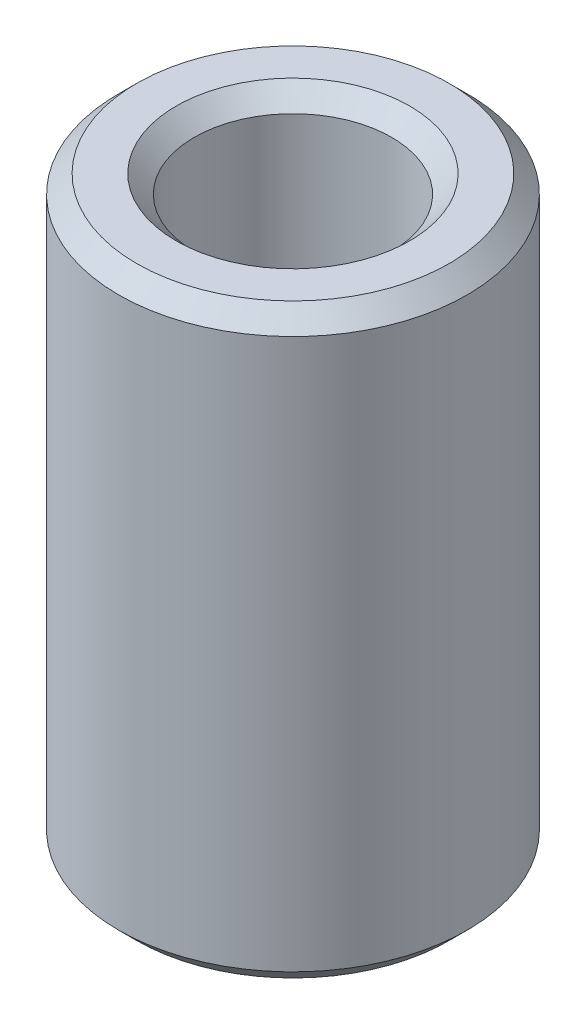
ISO-10303-21;
HEADER;
FILE_DESCRIPTION(('STEP AP214'),'2;1');
FILE_NAME('part.step','',(''),(''),'','','');
FILE_SCHEMA(('AUTOMOTIVE_DESIGN { 1 0 10303 214 1 1 1 1 }'));
ENDSEC;
DATA;
#1=APPLICATION_CONTEXT('core data for automotive mechanical design processes');
#2=APPLICATION_PROTOCOL_DEFINITION('international standard','automotive_design',2000,#1);
#3=PRODUCT_CONTEXT('',#1,'mechanical');
#4=PRODUCT('Part','Part','',(#3));
#5=PRODUCT_RELATED_PRODUCT_CATEGORY('part','',(#4));
#6=PRODUCT_DEFINITION_FORMATION('','',#4);
#7=PRODUCT_DEFINITION_CONTEXT('part definition',#1,'design');
#8=PRODUCT_DEFINITION('design','',#6,#7);
#9=PRODUCT_DEFINITION_SHAPE('','',#8);
#10=(LENGTH_UNIT() NAMED_UNIT(*) SI_UNIT(.MILLI.,.METRE.));
#11=(NAMED_UNIT(*) PLANE_ANGLE_UNIT() SI_UNIT($,.RADIAN.));
#12=(NAMED_UNIT(*) SI_UNIT($,.STERADIAN.) SOLID_ANGLE_UNIT());
#13=UNCERTAINTY_MEASURE_WITH_UNIT(LENGTH_MEASURE(1.E-05),#10,'distance_accuracy_value','');
#14=(GEOMETRIC_REPRESENTATION_CONTEXT(3) GLOBAL_UNCERTAINTY_ASSIGNED_CONTEXT((#13)) GLOBAL_UNIT_ASSIGNED_CONTEXT((#10,
#11,#12)) REPRESENTATION_CONTEXT('',''));
#15=CARTESIAN_POINT('',(0.,0.,0.));
#16=DIRECTION('',(0.,0.,1.));
#17=DIRECTION('',(1.,0.,0.));
#18=AXIS2_PLACEMENT_3D('',#15,#16,#17);
#19=CARTESIAN_POINT('',(0.,16.8244387498127,0.));
#20=DIRECTION('',(0.,-1.,0.));
#21=DIRECTION('',(0.,0.,-1.));
#22=AXIS2_PLACEMENT_3D('',#19,#20,#21);
#23=CYLINDRICAL_SURFACE('',#22,5.);
#24=CARTESIAN_POINT('',(0.,0.518395028354161,0.));
#25=DIRECTION('',(0.,1.,0.));
#26=DIRECTION('',(0.,0.,1.));
#27=AXIS2_PLACEMENT_3D('',#24,#25,#26);
#28=CIRCLE('',#27,5.);
#29=CARTESIAN_POINT('',(0.,0.518395028354161,5.));
#30=VERTEX_POINT('',#29);
#31=EDGE_CURVE('E10',#30,#30,#28,.T.);
#32=ORIENTED_EDGE('',*,*,#31,.T.);
#33=EDGE_LOOP('',(#32));
#34=FACE_BOUND('',#33,.T.);
#35=CARTESIAN_POINT('',(0.,16.3060437214585,0.));
#36=DIRECTION('',(0.,1.,0.));
#37=DIRECTION('',(0.,0.,1.));
#38=AXIS2_PLACEMENT_3D('',#35,#36,#37);
#39=CIRCLE('',#38,5.);
#40=CARTESIAN_POINT('',(0.,16.3060437214585,5.));
#41=VERTEX_POINT('',#40);
#42=EDGE_CURVE('E50',#41,#41,#39,.F.);
#43=ORIENTED_EDGE('',*,*,#42,.T.);
#44=EDGE_LOOP('',(#43));
#45=FACE_BOUND('',#44,.T.);
#46=ADVANCED_FACE('F39',(#34,#45),#23,.T.);
#47=CARTESIAN_POINT('',(0.,16.8244387498127,0.));
#48=DIRECTION('',(0.,1.,0.));
#49=DIRECTION('',(0.,0.,1.));
#50=AXIS2_PLACEMENT_3D('',#47,#48,#49);
#51=PLANE('',#50);
#52=CARTESIAN_POINT('',(0.,16.8244387498127,0.));
#53=DIRECTION('',(0.,1.,0.));
#54=DIRECTION('',(0.,0.,1.));
#55=AXIS2_PLACEMENT_3D('',#52,#53,#54);
#56=CIRCLE('',#55,3.35193239847378);
#57=CARTESIAN_POINT('',(0.,16.8244387498127,3.35193239847378));
#58=VERTEX_POINT('',#57);
#59=EDGE_CURVE('E58',#58,#58,#56,.F.);
#60=ORIENTED_EDGE('',*,*,#59,.T.);
#61=EDGE_LOOP('',(#60));
#62=FACE_BOUND('',#61,.T.);
#63=CARTESIAN_POINT('',(0.,16.8244387498127,0.));
#64=DIRECTION('',(0.,1.,0.));
#65=DIRECTION('',(0.,0.,1.));
#66=AXIS2_PLACEMENT_3D('',#63,#64,#65);
#67=CIRCLE('',#66,4.48160497164584);
#68=CARTESIAN_POINT('',(0.,16.8244387498127,4.48160497164584));
#69=VERTEX_POINT('',#68);
#70=EDGE_CURVE('E61',#69,#69,#67,.T.);
#71=ORIENTED_EDGE('',*,*,#70,.T.);
#72=EDGE_LOOP('',(#71));
#73=FACE_BOUND('',#72,.T.);
#74=ADVANCED_FACE('F88',(#62,#73),#51,.T.);
#75=CARTESIAN_POINT('',(0.,0.,0.));
#76=DIRECTION('',(0.,1.,0.));
#77=DIRECTION('',(0.,0.,1.));
#78=AXIS2_PLACEMENT_3D('',#75,#76,#77);
#79=PLANE('',#78);
#80=CARTESIAN_POINT('',(0.,0.,0.));
#81=DIRECTION('',(0.,1.,0.));
#82=DIRECTION('',(0.,0.,1.));
#83=AXIS2_PLACEMENT_3D('',#80,#81,#82);
#84=CIRCLE('',#83,3.35193239847378);
#85=CARTESIAN_POINT('',(0.,0.,3.35193239847378));
#86=VERTEX_POINT('',#85);
#87=EDGE_CURVE('E51',#86,#86,#84,.T.);
#88=ORIENTED_EDGE('',*,*,#87,.T.);
#89=EDGE_LOOP('',(#88));
#90=FACE_BOUND('',#89,.T.);
#91=CARTESIAN_POINT('',(0.,0.,0.));
#92=DIRECTION('',(0.,1.,0.));
#93=DIRECTION('',(0.,0.,1.));
#94=AXIS2_PLACEMENT_3D('',#91,#92,#93);
#95=CIRCLE('',#94,4.48160497164583);
#96=CARTESIAN_POINT('',(0.,0.,4.48160497164583));
#97=VERTEX_POINT('',#96);
#98=EDGE_CURVE('E54',#97,#97,#95,.F.);
#99=ORIENTED_EDGE('',*,*,#98,.T.);
#100=EDGE_LOOP('',(#99));
#101=FACE_BOUND('',#100,.T.);
#102=ADVANCED_FACE('F83',(#90,#101),#79,.F.);
#103=CARTESIAN_POINT('',(0.,16.8244387498127,0.));
#104=DIRECTION('',(0.,-1.,0.));
#105=DIRECTION('',(0.,0.,-1.));
#106=AXIS2_PLACEMENT_3D('',#103,#104,#105);
#107=CYLINDRICAL_SURFACE('',#106,2.83353737011961);
#108=CARTESIAN_POINT('',(0.,16.3060437214585,0.));
#109=DIRECTION('',(0.,1.,0.));
#110=DIRECTION('',(0.,0.,1.));
#111=AXIS2_PLACEMENT_3D('',#108,#109,#110);
#112=CIRCLE('',#111,2.83353737011961);
#113=CARTESIAN_POINT('',(0.,16.3060437214585,2.83353737011961));
#114=VERTEX_POINT('',#113);
#115=EDGE_CURVE('E67',#114,#114,#112,.T.);
#116=ORIENTED_EDGE('',*,*,#115,.T.);
#117=EDGE_LOOP('',(#116));
#118=FACE_BOUND('',#117,.T.);
#119=CARTESIAN_POINT('',(0.,0.518395028354168,0.));
#120=DIRECTION('',(0.,1.,0.));
#121=DIRECTION('',(0.,0.,1.));
#122=AXIS2_PLACEMENT_3D('',#119,#120,#121);
#123=CIRCLE('',#122,2.83353737011961);
#124=CARTESIAN_POINT('',(0.,0.518395028354168,2.83353737011961));
#125=VERTEX_POINT('',#124);
#126=EDGE_CURVE('E69',#125,#125,#123,.F.);
#127=ORIENTED_EDGE('',*,*,#126,.T.);
#128=EDGE_LOOP('',(#127));
#129=FACE_BOUND('',#128,.T.);
#130=ADVANCED_FACE('F71',(#118,#129),#107,.F.);
#131=CARTESIAN_POINT('',(0.,16.3060437214585,0.));
#132=DIRECTION('',(0.,1.,0.));
#133=DIRECTION('',(0.,0.,1.));
#134=AXIS2_PLACEMENT_3D('',#131,#132,#133);
#135=CONICAL_SURFACE('',#134,2.83353737011961,0.785398163397456);
#136=ORIENTED_EDGE('',*,*,#59,.F.);
#137=EDGE_LOOP('',(#136));
#138=FACE_BOUND('',#137,.T.);
#139=ORIENTED_EDGE('',*,*,#115,.F.);
#140=EDGE_LOOP('',(#139));
#141=FACE_BOUND('',#140,.T.);
#142=ADVANCED_FACE('F77',(#138,#141),#135,.F.);
#143=CARTESIAN_POINT('',(0.,0.,0.));
#144=DIRECTION('',(0.,-1.,0.));
#145=DIRECTION('',(0.,0.,-1.));
#146=AXIS2_PLACEMENT_3D('',#143,#144,#145);
#147=CONICAL_SURFACE('',#146,3.35193239847378,0.785398163397448);
#148=ORIENTED_EDGE('',*,*,#126,.F.);
#149=EDGE_LOOP('',(#148));
#150=FACE_BOUND('',#149,.T.);
#151=ORIENTED_EDGE('',*,*,#87,.F.);
#152=EDGE_LOOP('',(#151));
#153=FACE_BOUND('',#152,.T.);
#154=ADVANCED_FACE('F73',(#150,#153),#147,.F.);
#155=CARTESIAN_POINT('',(0.,0.518395028354161,0.));
#156=DIRECTION('',(0.,1.,0.));
#157=DIRECTION('',(0.,0.,1.));
#158=AXIS2_PLACEMENT_3D('',#155,#156,#157);
#159=CONICAL_SURFACE('',#158,5.,0.785398163397452);
#160=ORIENTED_EDGE('',*,*,#98,.F.);
#161=EDGE_LOOP('',(#160));
#162=FACE_BOUND('',#161,.T.);
#163=ORIENTED_EDGE('',*,*,#31,.F.);
#164=EDGE_LOOP('',(#163));
#165=FACE_BOUND('',#164,.T.);
#166=ADVANCED_FACE('F76',(#162,#165),#159,.T.);
#167=CARTESIAN_POINT('',(0.,16.8244387498127,0.));
#168=DIRECTION('',(0.,-1.,0.));
#169=DIRECTION('',(0.,0.,-1.));
#170=AXIS2_PLACEMENT_3D('',#167,#168,#169);
#171=CONICAL_SURFACE('',#170,4.48160497164584,0.785398163397444);
#172=ORIENTED_EDGE('',*,*,#42,.F.);
#173=EDGE_LOOP('',(#172));
#174=FACE_BOUND('',#173,.T.);
#175=ORIENTED_EDGE('',*,*,#70,.F.);
#176=EDGE_LOOP('',(#175));
#177=FACE_BOUND('',#176,.T.);
#178=ADVANCED_FACE('F45',(#174,#177),#171,.T.);
#179=CLOSED_SHELL('',(#46,#74,#102,#130,#142,#154,#166,#178));
#180=MANIFOLD_SOLID_BREP('B2',#179);
#181=ADVANCED_BREP_SHAPE_REPRESENTATION('',(#18,#180),#14);
#182=SHAPE_DEFINITION_REPRESENTATION(#9,#181);
ENDSEC;
END-ISO-10303-21;
